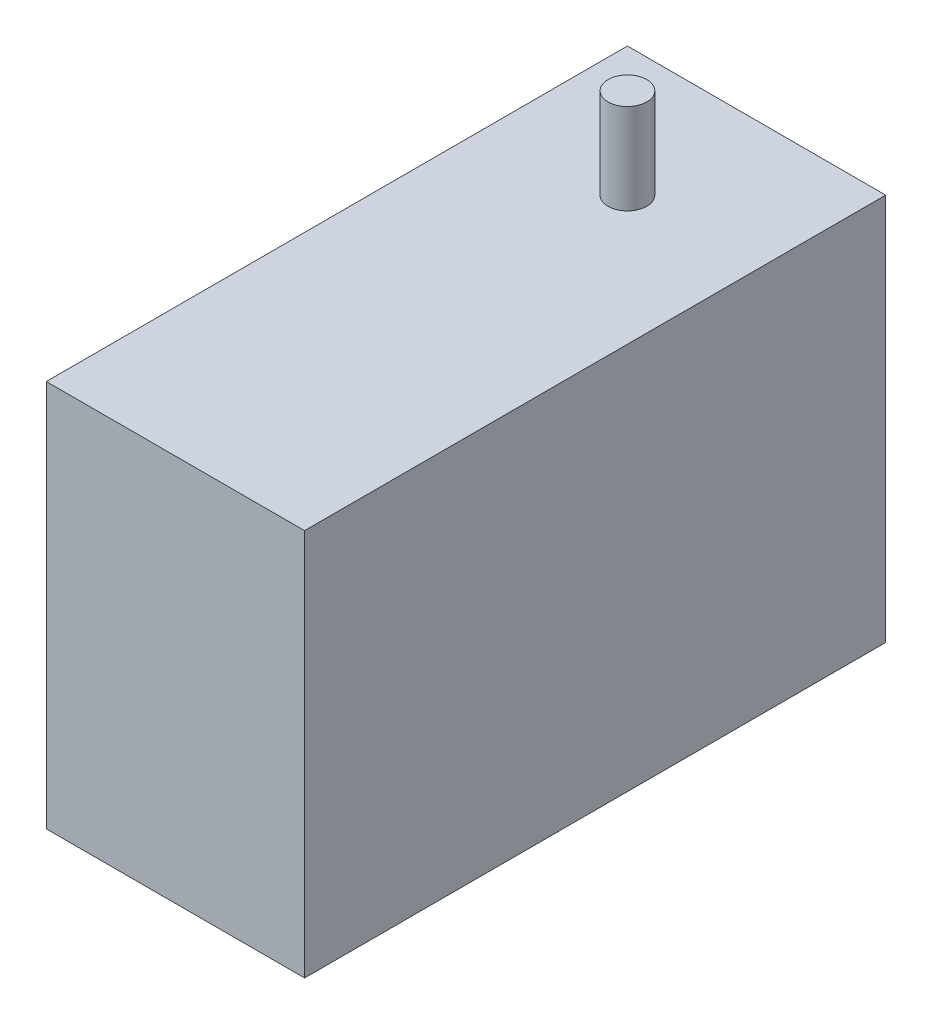
ISO-10303-21;
HEADER;
FILE_DESCRIPTION(('STEP AP214'),'2;1');
FILE_NAME('part.step','',(''),(''),'','','');
FILE_SCHEMA(('AUTOMOTIVE_DESIGN { 1 0 10303 214 1 1 1 1 }'));
ENDSEC;
DATA;
#1=APPLICATION_CONTEXT('core data for automotive mechanical design processes');
#2=APPLICATION_PROTOCOL_DEFINITION('international standard','automotive_design',2000,#1);
#3=PRODUCT_CONTEXT('',#1,'mechanical');
#4=PRODUCT('Part','Part','',(#3));
#5=PRODUCT_RELATED_PRODUCT_CATEGORY('part','',(#4));
#6=PRODUCT_DEFINITION_FORMATION('','',#4);
#7=PRODUCT_DEFINITION_CONTEXT('part definition',#1,'design');
#8=PRODUCT_DEFINITION('design','',#6,#7);
#9=PRODUCT_DEFINITION_SHAPE('','',#8);
#10=(LENGTH_UNIT() NAMED_UNIT(*) SI_UNIT(.MILLI.,.METRE.));
#11=(NAMED_UNIT(*) PLANE_ANGLE_UNIT() SI_UNIT($,.RADIAN.));
#12=(NAMED_UNIT(*) SI_UNIT($,.STERADIAN.) SOLID_ANGLE_UNIT());
#13=UNCERTAINTY_MEASURE_WITH_UNIT(LENGTH_MEASURE(1.E-05),#10,'distance_accuracy_value','');
#14=(GEOMETRIC_REPRESENTATION_CONTEXT(3) GLOBAL_UNCERTAINTY_ASSIGNED_CONTEXT((#13)) GLOBAL_UNIT_ASSIGNED_CONTEXT((#10,
#11,#12)) REPRESENTATION_CONTEXT('',''));
#15=CARTESIAN_POINT('',(0.,0.,0.));
#16=DIRECTION('',(0.,0.,1.));
#17=DIRECTION('',(1.,0.,0.));
#18=AXIS2_PLACEMENT_3D('',#15,#16,#17);
#19=CARTESIAN_POINT('',(0.,30.,0.));
#20=DIRECTION('',(0.,1.,0.));
#21=DIRECTION('',(0.,0.,1.));
#22=AXIS2_PLACEMENT_3D('',#19,#20,#21);
#23=PLANE('',#22);
#24=DIRECTION('',(0.,0.,-1.));
#25=VECTOR('',#24,1.);
#26=CARTESIAN_POINT('',(10.,30.,-22.5));
#27=LINE('',#26,#25);
#28=CARTESIAN_POINT('',(10.,30.,22.5));
#29=VERTEX_POINT('',#28);
#30=CARTESIAN_POINT('',(10.,30.,-22.5));
#31=VERTEX_POINT('',#30);
#32=EDGE_CURVE('E134',#29,#31,#27,.T.);
#33=ORIENTED_EDGE('',*,*,#32,.T.);
#34=DIRECTION('',(-1.,0.,0.));
#35=VECTOR('',#34,1.);
#36=CARTESIAN_POINT('',(-10.,30.,-22.5));
#37=LINE('',#36,#35);
#38=CARTESIAN_POINT('',(-10.,30.,-22.5));
#39=VERTEX_POINT('',#38);
#40=EDGE_CURVE('E81',#31,#39,#37,.T.);
#41=ORIENTED_EDGE('',*,*,#40,.T.);
#42=DIRECTION('',(0.,0.,1.));
#43=VECTOR('',#42,1.);
#44=CARTESIAN_POINT('',(-10.,30.,-22.5));
#45=LINE('',#44,#43);
#46=CARTESIAN_POINT('',(-10.,30.,22.5));
#47=VERTEX_POINT('',#46);
#48=EDGE_CURVE('E137',#39,#47,#45,.T.);
#49=ORIENTED_EDGE('',*,*,#48,.T.);
#50=DIRECTION('',(1.,0.,0.));
#51=VECTOR('',#50,1.);
#52=CARTESIAN_POINT('',(-10.,30.,22.5));
#53=LINE('',#52,#51);
#54=EDGE_CURVE('E50',#47,#29,#53,.T.);
#55=ORIENTED_EDGE('',*,*,#54,.T.);
#56=EDGE_LOOP('',(#33,#41,#49,#55));
#57=FACE_BOUND('',#56,.T.);
#58=CARTESIAN_POINT('',(0.,30.,-12.5));
#59=DIRECTION('',(0.,1.,0.));
#60=DIRECTION('',(0.,0.,1.));
#61=AXIS2_PLACEMENT_3D('',#58,#59,#60);
#62=CIRCLE('',#61,1.5);
#63=CARTESIAN_POINT('',(0.,30.,-11.));
#64=VERTEX_POINT('',#63);
#65=EDGE_CURVE('E127',#64,#64,#62,.T.);
#66=ORIENTED_EDGE('',*,*,#65,.F.);
#67=EDGE_LOOP('',(#66));
#68=FACE_BOUND('',#67,.T.);
#69=ADVANCED_FACE('F33',(#57,#68),#23,.T.);
#70=CARTESIAN_POINT('',(10.,30.,-22.5));
#71=DIRECTION('',(-1.,0.,0.));
#72=DIRECTION('',(0.,0.,1.));
#73=AXIS2_PLACEMENT_3D('',#70,#71,#72);
#74=PLANE('',#73);
#75=DIRECTION('',(0.,0.,-1.));
#76=VECTOR('',#75,1.);
#77=CARTESIAN_POINT('',(10.,0.,-22.5));
#78=LINE('',#77,#76);
#79=CARTESIAN_POINT('',(10.,0.,22.5));
#80=VERTEX_POINT('',#79);
#81=CARTESIAN_POINT('',(10.,0.,-22.5));
#82=VERTEX_POINT('',#81);
#83=EDGE_CURVE('E131',#80,#82,#78,.T.);
#84=ORIENTED_EDGE('',*,*,#83,.T.);
#85=DIRECTION('',(0.,-1.,0.));
#86=VECTOR('',#85,1.);
#87=CARTESIAN_POINT('',(10.,30.,-22.5));
#88=LINE('',#87,#86);
#89=EDGE_CURVE('E11',#31,#82,#88,.T.);
#90=ORIENTED_EDGE('',*,*,#89,.F.);
#91=ORIENTED_EDGE('',*,*,#32,.F.);
#92=DIRECTION('',(0.,-1.,0.));
#93=VECTOR('',#92,1.);
#94=CARTESIAN_POINT('',(10.,30.,22.5));
#95=LINE('',#94,#93);
#96=EDGE_CURVE('E140',#29,#80,#95,.T.);
#97=ORIENTED_EDGE('',*,*,#96,.T.);
#98=EDGE_LOOP('',(#84,#90,#91,#97));
#99=FACE_BOUND('',#98,.T.);
#100=ADVANCED_FACE('F35',(#99),#74,.F.);
#101=CARTESIAN_POINT('',(-10.,30.,-22.5));
#102=DIRECTION('',(0.,0.,1.));
#103=DIRECTION('',(1.,0.,0.));
#104=AXIS2_PLACEMENT_3D('',#101,#102,#103);
#105=PLANE('',#104);
#106=DIRECTION('',(-1.,0.,0.));
#107=VECTOR('',#106,1.);
#108=CARTESIAN_POINT('',(-10.,0.,-22.5));
#109=LINE('',#108,#107);
#110=CARTESIAN_POINT('',(-10.,0.,-22.5));
#111=VERTEX_POINT('',#110);
#112=EDGE_CURVE('E143',#82,#111,#109,.T.);
#113=ORIENTED_EDGE('',*,*,#112,.T.);
#114=DIRECTION('',(0.,-1.,0.));
#115=VECTOR('',#114,1.);
#116=CARTESIAN_POINT('',(-10.,30.,-22.5));
#117=LINE('',#116,#115);
#118=EDGE_CURVE('E42',#39,#111,#117,.T.);
#119=ORIENTED_EDGE('',*,*,#118,.F.);
#120=ORIENTED_EDGE('',*,*,#40,.F.);
#121=ORIENTED_EDGE('',*,*,#89,.T.);
#122=EDGE_LOOP('',(#113,#119,#120,#121));
#123=FACE_BOUND('',#122,.T.);
#124=ADVANCED_FACE('F167',(#123),#105,.F.);
#125=CARTESIAN_POINT('',(-10.,30.,-22.5));
#126=DIRECTION('',(1.,0.,0.));
#127=DIRECTION('',(0.,0.,-1.));
#128=AXIS2_PLACEMENT_3D('',#125,#126,#127);
#129=PLANE('',#128);
#130=CARTESIAN_POINT('',(-10.,7.5,-12.8));
#131=DIRECTION('',(-1.,0.,0.));
#132=DIRECTION('',(0.,0.,1.));
#133=AXIS2_PLACEMENT_3D('',#130,#131,#132);
#134=CIRCLE('',#133,1.18745);
#135=CARTESIAN_POINT('',(-10.,7.5,-11.61255));
#136=VERTEX_POINT('',#135);
#137=EDGE_CURVE('E105',#136,#136,#134,.T.);
#138=ORIENTED_EDGE('',*,*,#137,.F.);
#139=EDGE_LOOP('',(#138));
#140=FACE_BOUND('',#139,.T.);
#141=CARTESIAN_POINT('',(-10.,22.5,-12.8));
#142=DIRECTION('',(-1.,0.,0.));
#143=DIRECTION('',(0.,0.,1.));
#144=AXIS2_PLACEMENT_3D('',#141,#142,#143);
#145=CIRCLE('',#144,1.18745);
#146=CARTESIAN_POINT('',(-10.,22.5,-11.61255));
#147=VERTEX_POINT('',#146);
#148=EDGE_CURVE('E104',#147,#147,#145,.T.);
#149=ORIENTED_EDGE('',*,*,#148,.F.);
#150=EDGE_LOOP('',(#149));
#151=FACE_BOUND('',#150,.T.);
#152=CARTESIAN_POINT('',(-10.,22.5,14.5));
#153=DIRECTION('',(-1.,0.,0.));
#154=DIRECTION('',(0.,0.,1.));
#155=AXIS2_PLACEMENT_3D('',#152,#153,#154);
#156=CIRCLE('',#155,1.18745);
#157=CARTESIAN_POINT('',(-10.,22.5,15.68745));
#158=VERTEX_POINT('',#157);
#159=EDGE_CURVE('E115',#158,#158,#156,.T.);
#160=ORIENTED_EDGE('',*,*,#159,.F.);
#161=EDGE_LOOP('',(#160));
#162=FACE_BOUND('',#161,.T.);
#163=CARTESIAN_POINT('',(-10.,7.5,14.5));
#164=DIRECTION('',(-1.,0.,0.));
#165=DIRECTION('',(0.,0.,1.));
#166=AXIS2_PLACEMENT_3D('',#163,#164,#165);
#167=CIRCLE('',#166,1.18745);
#168=CARTESIAN_POINT('',(-10.,7.5,15.68745));
#169=VERTEX_POINT('',#168);
#170=EDGE_CURVE('E121',#169,#169,#167,.T.);
#171=ORIENTED_EDGE('',*,*,#170,.F.);
#172=EDGE_LOOP('',(#171));
#173=FACE_BOUND('',#172,.T.);
#174=DIRECTION('',(0.,0.,1.));
#175=VECTOR('',#174,1.);
#176=CARTESIAN_POINT('',(-10.,0.,-22.5));
#177=LINE('',#176,#175);
#178=CARTESIAN_POINT('',(-10.,0.,22.5));
#179=VERTEX_POINT('',#178);
#180=EDGE_CURVE('E68',#111,#179,#177,.T.);
#181=ORIENTED_EDGE('',*,*,#180,.T.);
#182=DIRECTION('',(0.,-1.,0.));
#183=VECTOR('',#182,1.);
#184=CARTESIAN_POINT('',(-10.,30.,22.5));
#185=LINE('',#184,#183);
#186=EDGE_CURVE('E148',#47,#179,#185,.T.);
#187=ORIENTED_EDGE('',*,*,#186,.F.);
#188=ORIENTED_EDGE('',*,*,#48,.F.);
#189=ORIENTED_EDGE('',*,*,#118,.T.);
#190=EDGE_LOOP('',(#181,#187,#188,#189));
#191=FACE_BOUND('',#190,.T.);
#192=ADVANCED_FACE('F150',(#140,#151,#162,#173,#191),#129,.F.);
#193=CARTESIAN_POINT('',(-10.,30.,22.5));
#194=DIRECTION('',(0.,0.,-1.));
#195=DIRECTION('',(-1.,0.,0.));
#196=AXIS2_PLACEMENT_3D('',#193,#194,#195);
#197=PLANE('',#196);
#198=DIRECTION('',(1.,0.,0.));
#199=VECTOR('',#198,1.);
#200=CARTESIAN_POINT('',(-10.,0.,22.5));
#201=LINE('',#200,#199);
#202=EDGE_CURVE('E74',#179,#80,#201,.T.);
#203=ORIENTED_EDGE('',*,*,#202,.T.);
#204=ORIENTED_EDGE('',*,*,#96,.F.);
#205=ORIENTED_EDGE('',*,*,#54,.F.);
#206=ORIENTED_EDGE('',*,*,#186,.T.);
#207=EDGE_LOOP('',(#203,#204,#205,#206));
#208=FACE_BOUND('',#207,.T.);
#209=ADVANCED_FACE('F157',(#208),#197,.F.);
#210=CARTESIAN_POINT('',(0.,0.,0.));
#211=DIRECTION('',(0.,1.,0.));
#212=DIRECTION('',(0.,0.,1.));
#213=AXIS2_PLACEMENT_3D('',#210,#211,#212);
#214=PLANE('',#213);
#215=ORIENTED_EDGE('',*,*,#83,.F.);
#216=ORIENTED_EDGE('',*,*,#202,.F.);
#217=ORIENTED_EDGE('',*,*,#180,.F.);
#218=ORIENTED_EDGE('',*,*,#112,.F.);
#219=EDGE_LOOP('',(#215,#216,#217,#218));
#220=FACE_BOUND('',#219,.T.);
#221=ADVANCED_FACE('F153',(#220),#214,.F.);
#222=CARTESIAN_POINT('',(0.,37.,-12.5));
#223=DIRECTION('',(0.,-1.,0.));
#224=DIRECTION('',(0.,0.,-1.));
#225=AXIS2_PLACEMENT_3D('',#222,#223,#224);
#226=CYLINDRICAL_SURFACE('',#225,1.5);
#227=CARTESIAN_POINT('',(0.,37.,-12.5));
#228=DIRECTION('',(0.,1.,0.));
#229=DIRECTION('',(0.,0.,1.));
#230=AXIS2_PLACEMENT_3D('',#227,#228,#229);
#231=CIRCLE('',#230,1.5);
#232=CARTESIAN_POINT('',(0.,37.,-11.));
#233=VERTEX_POINT('',#232);
#234=EDGE_CURVE('E128',#233,#233,#231,.T.);
#235=ORIENTED_EDGE('',*,*,#234,.F.);
#236=EDGE_LOOP('',(#235));
#237=FACE_BOUND('',#236,.T.);
#238=ORIENTED_EDGE('',*,*,#65,.T.);
#239=EDGE_LOOP('',(#238));
#240=FACE_BOUND('',#239,.T.);
#241=ADVANCED_FACE('F164',(#237,#240),#226,.T.);
#242=CARTESIAN_POINT('',(0.,37.,-12.5));
#243=DIRECTION('',(0.,1.,0.));
#244=DIRECTION('',(0.,0.,1.));
#245=AXIS2_PLACEMENT_3D('',#242,#243,#244);
#246=PLANE('',#245);
#247=ORIENTED_EDGE('',*,*,#234,.T.);
#248=EDGE_LOOP('',(#247));
#249=FACE_BOUND('',#248,.T.);
#250=ADVANCED_FACE('F181',(#249),#246,.T.);
#251=CARTESIAN_POINT('',(-6.5,7.5,14.5));
#252=DIRECTION('',(-1.,0.,0.));
#253=DIRECTION('',(0.,0.,1.));
#254=AXIS2_PLACEMENT_3D('',#251,#252,#253);
#255=CONICAL_SURFACE('',#254,1.18745,1.02974425867665);
#256=CARTESIAN_POINT('',(-5.78650805793572,7.5,14.5));
#257=VERTEX_POINT('',#256);
#258=VERTEX_LOOP('',#257);
#259=FACE_BOUND('',#258,.T.);
#260=CARTESIAN_POINT('',(-6.5,7.5,14.5));
#261=DIRECTION('',(-1.,0.,0.));
#262=DIRECTION('',(0.,0.,1.));
#263=AXIS2_PLACEMENT_3D('',#260,#261,#262);
#264=CIRCLE('',#263,1.18745);
#265=CARTESIAN_POINT('',(-6.5,7.5,15.68745));
#266=VERTEX_POINT('',#265);
#267=EDGE_CURVE('E124',#266,#266,#264,.T.);
#268=ORIENTED_EDGE('',*,*,#267,.T.);
#269=EDGE_LOOP('',(#268));
#270=FACE_BOUND('',#269,.T.);
#271=ADVANCED_FACE('F185',(#259,#270),#255,.F.);
#272=CARTESIAN_POINT('',(-10.,7.5,14.5));
#273=DIRECTION('',(-1.,0.,0.));
#274=DIRECTION('',(0.,0.,1.));
#275=AXIS2_PLACEMENT_3D('',#272,#273,#274);
#276=CYLINDRICAL_SURFACE('',#275,1.18745);
#277=ORIENTED_EDGE('',*,*,#267,.F.);
#278=EDGE_LOOP('',(#277));
#279=FACE_BOUND('',#278,.T.);
#280=ORIENTED_EDGE('',*,*,#170,.T.);
#281=EDGE_LOOP('',(#280));
#282=FACE_BOUND('',#281,.T.);
#283=ADVANCED_FACE('F189',(#279,#282),#276,.F.);
#284=CARTESIAN_POINT('',(-6.5,22.5,14.5));
#285=DIRECTION('',(-1.,0.,0.));
#286=DIRECTION('',(0.,0.,1.));
#287=AXIS2_PLACEMENT_3D('',#284,#285,#286);
#288=CONICAL_SURFACE('',#287,1.18745,1.02974425867665);
#289=CARTESIAN_POINT('',(-5.78650805793572,22.5,14.5));
#290=VERTEX_POINT('',#289);
#291=VERTEX_LOOP('',#290);
#292=FACE_BOUND('',#291,.T.);
#293=CARTESIAN_POINT('',(-6.5,22.5,14.5));
#294=DIRECTION('',(-1.,0.,0.));
#295=DIRECTION('',(0.,0.,1.));
#296=AXIS2_PLACEMENT_3D('',#293,#294,#295);
#297=CIRCLE('',#296,1.18745);
#298=CARTESIAN_POINT('',(-6.5,22.5,15.68745));
#299=VERTEX_POINT('',#298);
#300=EDGE_CURVE('E118',#299,#299,#297,.T.);
#301=ORIENTED_EDGE('',*,*,#300,.T.);
#302=EDGE_LOOP('',(#301));
#303=FACE_BOUND('',#302,.T.);
#304=ADVANCED_FACE('F193',(#292,#303),#288,.F.);
#305=CARTESIAN_POINT('',(-10.,22.5,14.5));
#306=DIRECTION('',(-1.,0.,0.));
#307=DIRECTION('',(0.,0.,1.));
#308=AXIS2_PLACEMENT_3D('',#305,#306,#307);
#309=CYLINDRICAL_SURFACE('',#308,1.18745);
#310=ORIENTED_EDGE('',*,*,#300,.F.);
#311=EDGE_LOOP('',(#310));
#312=FACE_BOUND('',#311,.T.);
#313=ORIENTED_EDGE('',*,*,#159,.T.);
#314=EDGE_LOOP('',(#313));
#315=FACE_BOUND('',#314,.T.);
#316=ADVANCED_FACE('F197',(#312,#315),#309,.F.);
#317=CARTESIAN_POINT('',(-6.5,22.5,-12.8));
#318=DIRECTION('',(-1.,0.,0.));
#319=DIRECTION('',(0.,0.,1.));
#320=AXIS2_PLACEMENT_3D('',#317,#318,#319);
#321=CONICAL_SURFACE('',#320,1.18745,1.02974425867665);
#322=CARTESIAN_POINT('',(-5.78650805793573,22.5,-12.8));
#323=VERTEX_POINT('',#322);
#324=VERTEX_LOOP('',#323);
#325=FACE_BOUND('',#324,.T.);
#326=CARTESIAN_POINT('',(-6.5,22.5,-12.8));
#327=DIRECTION('',(-1.,0.,0.));
#328=DIRECTION('',(0.,0.,1.));
#329=AXIS2_PLACEMENT_3D('',#326,#327,#328);
#330=CIRCLE('',#329,1.18745);
#331=CARTESIAN_POINT('',(-6.5,22.5,-11.61255));
#332=VERTEX_POINT('',#331);
#333=EDGE_CURVE('E108',#332,#332,#330,.T.);
#334=ORIENTED_EDGE('',*,*,#333,.T.);
#335=EDGE_LOOP('',(#334));
#336=FACE_BOUND('',#335,.T.);
#337=ADVANCED_FACE('F201',(#325,#336),#321,.F.);
#338=CARTESIAN_POINT('',(-10.,22.5,-12.8));
#339=DIRECTION('',(-1.,0.,0.));
#340=DIRECTION('',(0.,0.,1.));
#341=AXIS2_PLACEMENT_3D('',#338,#339,#340);
#342=CYLINDRICAL_SURFACE('',#341,1.18745);
#343=ORIENTED_EDGE('',*,*,#333,.F.);
#344=EDGE_LOOP('',(#343));
#345=FACE_BOUND('',#344,.T.);
#346=ORIENTED_EDGE('',*,*,#148,.T.);
#347=EDGE_LOOP('',(#346));
#348=FACE_BOUND('',#347,.T.);
#349=ADVANCED_FACE('F98',(#345,#348),#342,.F.);
#350=CARTESIAN_POINT('',(-6.5,7.5,-12.8));
#351=DIRECTION('',(-1.,0.,0.));
#352=DIRECTION('',(0.,0.,1.));
#353=AXIS2_PLACEMENT_3D('',#350,#351,#352);
#354=CONICAL_SURFACE('',#353,1.18745,1.02974425867665);
#355=CARTESIAN_POINT('',(-5.78650805793573,7.5,-12.8));
#356=VERTEX_POINT('',#355);
#357=VERTEX_LOOP('',#356);
#358=FACE_BOUND('',#357,.T.);
#359=CARTESIAN_POINT('',(-6.5,7.5,-12.8));
#360=DIRECTION('',(-1.,0.,0.));
#361=DIRECTION('',(0.,0.,1.));
#362=AXIS2_PLACEMENT_3D('',#359,#360,#361);
#363=CIRCLE('',#362,1.18745);
#364=CARTESIAN_POINT('',(-6.5,7.5,-11.61255));
#365=VERTEX_POINT('',#364);
#366=EDGE_CURVE('E102',#365,#365,#363,.T.);
#367=ORIENTED_EDGE('',*,*,#366,.T.);
#368=EDGE_LOOP('',(#367));
#369=FACE_BOUND('',#368,.T.);
#370=ADVANCED_FACE('F94',(#358,#369),#354,.F.);
#371=CARTESIAN_POINT('',(-10.,7.5,-12.8));
#372=DIRECTION('',(-1.,0.,0.));
#373=DIRECTION('',(0.,0.,1.));
#374=AXIS2_PLACEMENT_3D('',#371,#372,#373);
#375=CYLINDRICAL_SURFACE('',#374,1.18745);
#376=ORIENTED_EDGE('',*,*,#366,.F.);
#377=EDGE_LOOP('',(#376));
#378=FACE_BOUND('',#377,.T.);
#379=ORIENTED_EDGE('',*,*,#137,.T.);
#380=EDGE_LOOP('',(#379));
#381=FACE_BOUND('',#380,.T.);
#382=ADVANCED_FACE('F97',(#378,#381),#375,.F.);
#383=CLOSED_SHELL('',(#69,#100,#124,#192,#209,#221,#241,#250,#271,#283,#304,#316,#337,#349,#370,#382));
#384=MANIFOLD_SOLID_BREP('B2',#383);
#385=ADVANCED_BREP_SHAPE_REPRESENTATION('',(#18,#384),#14);
#386=SHAPE_DEFINITION_REPRESENTATION(#9,#385);
ENDSEC;
END-ISO-10303-21;
